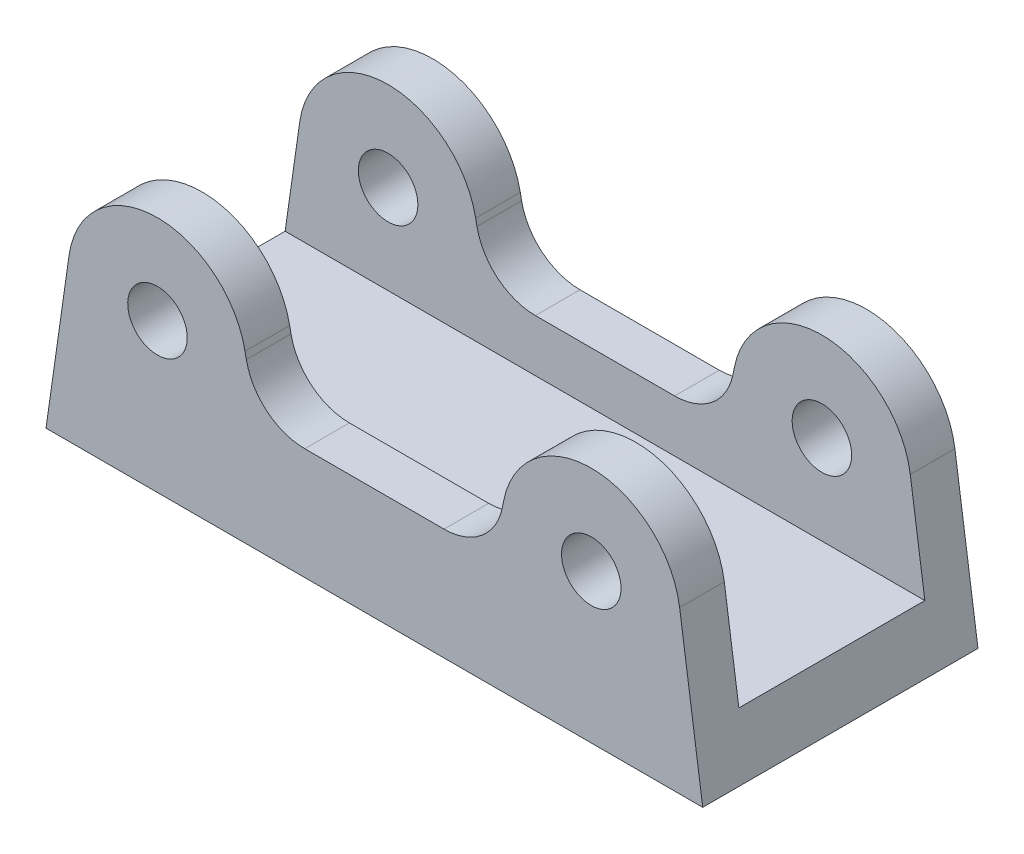
ISO-10303-21;
HEADER;
FILE_DESCRIPTION(('STEP AP214'),'2;1');
FILE_NAME('part.step','',(''),(''),'','','');
FILE_SCHEMA(('AUTOMOTIVE_DESIGN { 1 0 10303 214 1 1 1 1 }'));
ENDSEC;
DATA;
#1=APPLICATION_CONTEXT('core data for automotive mechanical design processes');
#2=APPLICATION_PROTOCOL_DEFINITION('international standard','automotive_design',2000,#1);
#3=PRODUCT_CONTEXT('',#1,'mechanical');
#4=PRODUCT('Part','Part','',(#3));
#5=PRODUCT_RELATED_PRODUCT_CATEGORY('part','',(#4));
#6=PRODUCT_DEFINITION_FORMATION('','',#4);
#7=PRODUCT_DEFINITION_CONTEXT('part definition',#1,'design');
#8=PRODUCT_DEFINITION('design','',#6,#7);
#9=PRODUCT_DEFINITION_SHAPE('','',#8);
#10=(LENGTH_UNIT() NAMED_UNIT(*) SI_UNIT(.MILLI.,.METRE.));
#11=(NAMED_UNIT(*) PLANE_ANGLE_UNIT() SI_UNIT($,.RADIAN.));
#12=(NAMED_UNIT(*) SI_UNIT($,.STERADIAN.) SOLID_ANGLE_UNIT());
#13=UNCERTAINTY_MEASURE_WITH_UNIT(LENGTH_MEASURE(1.E-05),#10,'distance_accuracy_value','');
#14=(GEOMETRIC_REPRESENTATION_CONTEXT(3) GLOBAL_UNCERTAINTY_ASSIGNED_CONTEXT((#13)) GLOBAL_UNIT_ASSIGNED_CONTEXT((#10,
#11,#12)) REPRESENTATION_CONTEXT('',''));
#15=CARTESIAN_POINT('',(0.,0.,0.));
#16=DIRECTION('',(0.,0.,1.));
#17=DIRECTION('',(1.,0.,0.));
#18=AXIS2_PLACEMENT_3D('',#15,#16,#17);
#19=CARTESIAN_POINT('',(-29.155,0.,18.5));
#20=DIRECTION('',(0.,0.,-1.));
#21=DIRECTION('',(-1.,0.,0.));
#22=AXIS2_PLACEMENT_3D('',#19,#20,#21);
#23=CYLINDRICAL_SURFACE('',#22,12.);
#24=DIRECTION('',(0.,0.,-1.));
#25=VECTOR('',#24,1.);
#26=CARTESIAN_POINT('',(-17.3836857304142,2.33155749803532,18.5));
#27=LINE('',#26,#25);
#28=CARTESIAN_POINT('',(-17.3836857304142,2.33155749803532,18.5));
#29=VERTEX_POINT('',#28);
#30=CARTESIAN_POINT('',(-17.3836857304142,2.33155749803532,12.5));
#31=VERTEX_POINT('',#30);
#32=EDGE_CURVE('E191',#29,#31,#27,.T.);
#33=ORIENTED_EDGE('',*,*,#32,.T.);
#34=CARTESIAN_POINT('',(-29.155,0.,12.5));
#35=DIRECTION('',(0.,0.,1.));
#36=DIRECTION('',(0.,-1.,0.));
#37=AXIS2_PLACEMENT_3D('',#34,#35,#36);
#38=CIRCLE('',#37,12.);
#39=CARTESIAN_POINT('',(-41.0341192879015,1.69897761721752,12.5));
#40=VERTEX_POINT('',#39);
#41=EDGE_CURVE('E259',#31,#40,#38,.T.);
#42=ORIENTED_EDGE('',*,*,#41,.T.);
#43=DIRECTION('',(0.,0.,-1.));
#44=VECTOR('',#43,1.);
#45=CARTESIAN_POINT('',(-41.0341192879015,1.69897761721752,18.5));
#46=LINE('',#45,#44);
#47=CARTESIAN_POINT('',(-41.0341192879015,1.69897761721752,18.5));
#48=VERTEX_POINT('',#47);
#49=EDGE_CURVE('E45',#48,#40,#46,.T.);
#50=ORIENTED_EDGE('',*,*,#49,.F.);
#51=CARTESIAN_POINT('',(-29.155,0.,18.5));
#52=DIRECTION('',(0.,0.,1.));
#53=DIRECTION('',(1.,0.,0.));
#54=AXIS2_PLACEMENT_3D('',#51,#52,#53);
#55=CIRCLE('',#54,12.);
#56=EDGE_CURVE('E190',#29,#48,#55,.T.);
#57=ORIENTED_EDGE('',*,*,#56,.F.);
#58=EDGE_LOOP('',(#33,#42,#50,#57));
#59=FACE_BOUND('',#58,.T.);
#60=ADVANCED_FACE('F37',(#59),#23,.T.);
#61=CARTESIAN_POINT('',(29.155,0.,18.5));
#62=DIRECTION('',(0.,0.,-1.));
#63=DIRECTION('',(-1.,0.,0.));
#64=AXIS2_PLACEMENT_3D('',#61,#62,#63);
#65=CYLINDRICAL_SURFACE('',#64,12.);
#66=DIRECTION('',(0.,0.,-1.));
#67=VECTOR('',#66,1.);
#68=CARTESIAN_POINT('',(41.0341192879015,1.69897761721752,18.5));
#69=LINE('',#68,#67);
#70=CARTESIAN_POINT('',(41.0341192879015,1.69897761721752,18.5));
#71=VERTEX_POINT('',#70);
#72=CARTESIAN_POINT('',(41.0341192879015,1.69897761721752,12.5));
#73=VERTEX_POINT('',#72);
#74=EDGE_CURVE('E207',#71,#73,#69,.T.);
#75=ORIENTED_EDGE('',*,*,#74,.T.);
#76=CARTESIAN_POINT('',(29.155,0.,12.5));
#77=DIRECTION('',(0.,0.,1.));
#78=DIRECTION('',(0.,-1.,0.));
#79=AXIS2_PLACEMENT_3D('',#76,#77,#78);
#80=CIRCLE('',#79,12.);
#81=CARTESIAN_POINT('',(17.3836857304142,2.33155749803532,12.5));
#82=VERTEX_POINT('',#81);
#83=EDGE_CURVE('E253',#73,#82,#80,.T.);
#84=ORIENTED_EDGE('',*,*,#83,.T.);
#85=DIRECTION('',(0.,0.,-1.));
#86=VECTOR('',#85,1.);
#87=CARTESIAN_POINT('',(17.3836857304142,2.33155749803532,18.5));
#88=LINE('',#87,#86);
#89=CARTESIAN_POINT('',(17.3836857304142,2.33155749803532,18.5));
#90=VERTEX_POINT('',#89);
#91=EDGE_CURVE('E203',#90,#82,#88,.T.);
#92=ORIENTED_EDGE('',*,*,#91,.F.);
#93=CARTESIAN_POINT('',(29.155,0.,18.5));
#94=DIRECTION('',(0.,0.,1.));
#95=DIRECTION('',(1.,0.,0.));
#96=AXIS2_PLACEMENT_3D('',#93,#94,#95);
#97=CIRCLE('',#96,12.);
#98=EDGE_CURVE('E284',#71,#90,#97,.T.);
#99=ORIENTED_EDGE('',*,*,#98,.F.);
#100=EDGE_LOOP('',(#75,#84,#92,#99));
#101=FACE_BOUND('',#100,.T.);
#102=ADVANCED_FACE('F334',(#101),#65,.T.);
#103=CARTESIAN_POINT('',(17.3836857304142,2.33155749803533,18.5));
#104=DIRECTION('',(0.980942855798827,-0.194296458169575,0.));
#105=DIRECTION('',(0.194296458169575,0.980942855798827,0.));
#106=AXIS2_PLACEMENT_3D('',#103,#104,#105);
#107=PLANE('',#106);
#108=ORIENTED_EDGE('',*,*,#91,.T.);
#109=DIRECTION('',(-0.194296458169575,-0.980942855798827,0.));
#110=VECTOR('',#109,1.);
#111=CARTESIAN_POINT('',(17.3836857304142,2.33155749803533,12.5));
#112=LINE('',#111,#110);
#113=CARTESIAN_POINT('',(17.2082087414962,1.4456283346434,12.5));
#114=VERTEX_POINT('',#113);
#115=EDGE_CURVE('E250',#82,#114,#112,.T.);
#116=ORIENTED_EDGE('',*,*,#115,.T.);
#117=DIRECTION('',(0.,0.,-1.));
#118=VECTOR('',#117,1.);
#119=CARTESIAN_POINT('',(17.2082087414962,1.4456283346434,18.5));
#120=LINE('',#119,#118);
#121=CARTESIAN_POINT('',(17.2082087414962,1.4456283346434,18.5));
#122=VERTEX_POINT('',#121);
#123=EDGE_CURVE('E199',#122,#114,#120,.T.);
#124=ORIENTED_EDGE('',*,*,#123,.F.);
#125=DIRECTION('',(-0.194296458169575,-0.980942855798827,0.));
#126=VECTOR('',#125,1.);
#127=CARTESIAN_POINT('',(17.3836857304142,2.33155749803533,18.5));
#128=LINE('',#127,#126);
#129=EDGE_CURVE('E286',#90,#122,#128,.T.);
#130=ORIENTED_EDGE('',*,*,#129,.F.);
#131=EDGE_LOOP('',(#108,#116,#124,#130));
#132=FACE_BOUND('',#131,.T.);
#133=ADVANCED_FACE('F292',(#132),#107,.F.);
#134=CARTESIAN_POINT('',(9.36066589510556,3.,18.5));
#135=DIRECTION('',(0.,0.,-1.));
#136=DIRECTION('',(-1.,0.,0.));
#137=AXIS2_PLACEMENT_3D('',#134,#135,#136);
#138=CYLINDRICAL_SURFACE('',#137,8.);
#139=ORIENTED_EDGE('',*,*,#123,.T.);
#140=CARTESIAN_POINT('',(9.36066589510556,3.,12.5));
#141=DIRECTION('',(0.,0.,1.));
#142=DIRECTION('',(0.,-1.,0.));
#143=AXIS2_PLACEMENT_3D('',#140,#141,#142);
#144=CIRCLE('',#143,8.);
#145=CARTESIAN_POINT('',(9.36066589510556,-5.,12.5));
#146=VERTEX_POINT('',#145);
#147=EDGE_CURVE('E247',#114,#146,#144,.F.);
#148=ORIENTED_EDGE('',*,*,#147,.T.);
#149=DIRECTION('',(0.,0.,-1.));
#150=VECTOR('',#149,1.);
#151=CARTESIAN_POINT('',(9.36066589510556,-5.,18.5));
#152=LINE('',#151,#150);
#153=CARTESIAN_POINT('',(9.36066589510556,-5.,18.5));
#154=VERTEX_POINT('',#153);
#155=EDGE_CURVE('E196',#154,#146,#152,.T.);
#156=ORIENTED_EDGE('',*,*,#155,.F.);
#157=CARTESIAN_POINT('',(9.36066589510556,3.,18.5));
#158=DIRECTION('',(0.,0.,-1.));
#159=DIRECTION('',(1.,0.,0.));
#160=AXIS2_PLACEMENT_3D('',#157,#158,#159);
#161=CIRCLE('',#160,8.);
#162=EDGE_CURVE('E139',#122,#154,#161,.T.);
#163=ORIENTED_EDGE('',*,*,#162,.F.);
#164=EDGE_LOOP('',(#139,#148,#156,#163));
#165=FACE_BOUND('',#164,.T.);
#166=ADVANCED_FACE('F296',(#165),#138,.F.);
#167=CARTESIAN_POINT('',(-9.36066589510556,-5.,18.5));
#168=DIRECTION('',(0.,-1.,0.));
#169=DIRECTION('',(1.,0.,0.));
#170=AXIS2_PLACEMENT_3D('',#167,#168,#169);
#171=PLANE('',#170);
#172=ORIENTED_EDGE('',*,*,#155,.T.);
#173=DIRECTION('',(-1.,0.,0.));
#174=VECTOR('',#173,1.);
#175=CARTESIAN_POINT('',(-9.36066589510556,-5.,12.5));
#176=LINE('',#175,#174);
#177=CARTESIAN_POINT('',(-9.36066589510556,-5.,12.5));
#178=VERTEX_POINT('',#177);
#179=EDGE_CURVE('E150',#146,#178,#176,.T.);
#180=ORIENTED_EDGE('',*,*,#179,.T.);
#181=DIRECTION('',(0.,0.,-1.));
#182=VECTOR('',#181,1.);
#183=CARTESIAN_POINT('',(-9.36066589510556,-5.,18.5));
#184=LINE('',#183,#182);
#185=CARTESIAN_POINT('',(-9.36066589510556,-5.,18.5));
#186=VERTEX_POINT('',#185);
#187=EDGE_CURVE('E146',#186,#178,#184,.T.);
#188=ORIENTED_EDGE('',*,*,#187,.F.);
#189=DIRECTION('',(-1.,0.,0.));
#190=VECTOR('',#189,1.);
#191=CARTESIAN_POINT('',(-9.36066589510556,-5.,18.5));
#192=LINE('',#191,#190);
#193=EDGE_CURVE('E131',#154,#186,#192,.T.);
#194=ORIENTED_EDGE('',*,*,#193,.F.);
#195=EDGE_LOOP('',(#172,#180,#188,#194));
#196=FACE_BOUND('',#195,.T.);
#197=ADVANCED_FACE('F147',(#196),#171,.F.);
#198=CARTESIAN_POINT('',(-9.36066589510556,3.,18.5));
#199=DIRECTION('',(0.,0.,-1.));
#200=DIRECTION('',(-1.,0.,0.));
#201=AXIS2_PLACEMENT_3D('',#198,#199,#200);
#202=CYLINDRICAL_SURFACE('',#201,8.);
#203=ORIENTED_EDGE('',*,*,#187,.T.);
#204=CARTESIAN_POINT('',(-9.36066589510556,3.,12.5));
#205=DIRECTION('',(0.,0.,1.));
#206=DIRECTION('',(0.,-1.,0.));
#207=AXIS2_PLACEMENT_3D('',#204,#205,#206);
#208=CIRCLE('',#207,8.);
#209=CARTESIAN_POINT('',(-17.2082087414962,1.4456283346434,12.5));
#210=VERTEX_POINT('',#209);
#211=EDGE_CURVE('E244',#178,#210,#208,.F.);
#212=ORIENTED_EDGE('',*,*,#211,.T.);
#213=DIRECTION('',(0.,0.,-1.));
#214=VECTOR('',#213,1.);
#215=CARTESIAN_POINT('',(-17.2082087414962,1.4456283346434,18.5));
#216=LINE('',#215,#214);
#217=CARTESIAN_POINT('',(-17.2082087414962,1.4456283346434,18.5));
#218=VERTEX_POINT('',#217);
#219=EDGE_CURVE('E158',#218,#210,#216,.T.);
#220=ORIENTED_EDGE('',*,*,#219,.F.);
#221=CARTESIAN_POINT('',(-9.36066589510556,3.,18.5));
#222=DIRECTION('',(0.,0.,-1.));
#223=DIRECTION('',(-1.,0.,0.));
#224=AXIS2_PLACEMENT_3D('',#221,#222,#223);
#225=CIRCLE('',#224,8.);
#226=EDGE_CURVE('E136',#186,#218,#225,.T.);
#227=ORIENTED_EDGE('',*,*,#226,.F.);
#228=EDGE_LOOP('',(#203,#212,#220,#227));
#229=FACE_BOUND('',#228,.T.);
#230=ADVANCED_FACE('F156',(#229),#202,.F.);
#231=CARTESIAN_POINT('',(-17.3836857304142,2.33155749803532,18.5));
#232=DIRECTION('',(-0.980942855798827,-0.194296458169575,0.));
#233=DIRECTION('',(0.194296458169575,-0.980942855798827,0.));
#234=AXIS2_PLACEMENT_3D('',#231,#232,#233);
#235=PLANE('',#234);
#236=ORIENTED_EDGE('',*,*,#219,.T.);
#237=DIRECTION('',(-0.194296458169575,0.980942855798827,0.));
#238=VECTOR('',#237,1.);
#239=CARTESIAN_POINT('',(-17.3836857304142,2.33155749803532,12.5));
#240=LINE('',#239,#238);
#241=EDGE_CURVE('E229',#210,#31,#240,.T.);
#242=ORIENTED_EDGE('',*,*,#241,.T.);
#243=ORIENTED_EDGE('',*,*,#32,.F.);
#244=DIRECTION('',(-0.194296458169575,0.980942855798827,0.));
#245=VECTOR('',#244,1.);
#246=CARTESIAN_POINT('',(-17.3836857304142,2.33155749803532,18.5));
#247=LINE('',#246,#245);
#248=EDGE_CURVE('E61',#218,#29,#247,.T.);
#249=ORIENTED_EDGE('',*,*,#248,.F.);
#250=EDGE_LOOP('',(#236,#242,#243,#249));
#251=FACE_BOUND('',#250,.T.);
#252=ADVANCED_FACE('F401',(#251),#235,.F.);
#253=CARTESIAN_POINT('',(29.155,0.,18.5));
#254=DIRECTION('',(0.,0.,-1.));
#255=DIRECTION('',(-1.,0.,0.));
#256=AXIS2_PLACEMENT_3D('',#253,#254,#255);
#257=CYLINDRICAL_SURFACE('',#256,4.00000000000001);
#258=CARTESIAN_POINT('',(29.155,0.,12.5));
#259=DIRECTION('',(0.,0.,1.));
#260=DIRECTION('',(0.,-1.,0.));
#261=AXIS2_PLACEMENT_3D('',#258,#259,#260);
#262=CIRCLE('',#261,4.00000000000001);
#263=CARTESIAN_POINT('',(29.155,-4.00000000000001,12.5));
#264=VERTEX_POINT('',#263);
#265=EDGE_CURVE('E224',#264,#264,#262,.T.);
#266=ORIENTED_EDGE('',*,*,#265,.F.);
#267=EDGE_LOOP('',(#266));
#268=FACE_BOUND('',#267,.T.);
#269=CARTESIAN_POINT('',(29.155,0.,18.5));
#270=DIRECTION('',(0.,0.,1.));
#271=DIRECTION('',(1.,0.,0.));
#272=AXIS2_PLACEMENT_3D('',#269,#270,#271);
#273=CIRCLE('',#272,4.00000000000001);
#274=CARTESIAN_POINT('',(33.155,0.,18.5));
#275=VERTEX_POINT('',#274);
#276=EDGE_CURVE('E166',#275,#275,#273,.T.);
#277=ORIENTED_EDGE('',*,*,#276,.T.);
#278=EDGE_LOOP('',(#277));
#279=FACE_BOUND('',#278,.T.);
#280=ADVANCED_FACE('F451',(#268,#279),#257,.F.);
#281=CARTESIAN_POINT('',(-29.155,0.,18.5));
#282=DIRECTION('',(0.,0.,-1.));
#283=DIRECTION('',(-1.,0.,0.));
#284=AXIS2_PLACEMENT_3D('',#281,#282,#283);
#285=CYLINDRICAL_SURFACE('',#284,4.);
#286=CARTESIAN_POINT('',(-29.155,0.,12.5));
#287=DIRECTION('',(0.,0.,1.));
#288=DIRECTION('',(0.,-1.,0.));
#289=AXIS2_PLACEMENT_3D('',#286,#287,#288);
#290=CIRCLE('',#289,4.);
#291=CARTESIAN_POINT('',(-29.155,-4.,12.5));
#292=VERTEX_POINT('',#291);
#293=EDGE_CURVE('E222',#292,#292,#290,.T.);
#294=ORIENTED_EDGE('',*,*,#293,.F.);
#295=EDGE_LOOP('',(#294));
#296=FACE_BOUND('',#295,.T.);
#297=CARTESIAN_POINT('',(-29.155,0.,18.5));
#298=DIRECTION('',(0.,0.,1.));
#299=DIRECTION('',(1.,0.,0.));
#300=AXIS2_PLACEMENT_3D('',#297,#298,#299);
#301=CIRCLE('',#300,4.);
#302=CARTESIAN_POINT('',(-25.155,0.,18.5));
#303=VERTEX_POINT('',#302);
#304=EDGE_CURVE('E268',#303,#303,#301,.T.);
#305=ORIENTED_EDGE('',*,*,#304,.T.);
#306=EDGE_LOOP('',(#305));
#307=FACE_BOUND('',#306,.T.);
#308=ADVANCED_FACE('F459',(#296,#307),#285,.F.);
#309=CARTESIAN_POINT('',(-29.155,0.,18.5));
#310=DIRECTION('',(0.,0.,1.));
#311=DIRECTION('',(1.,0.,0.));
#312=AXIS2_PLACEMENT_3D('',#309,#310,#311);
#313=PLANE('',#312);
#314=ORIENTED_EDGE('',*,*,#276,.F.);
#315=EDGE_LOOP('',(#314));
#316=FACE_BOUND('',#315,.T.);
#317=ORIENTED_EDGE('',*,*,#56,.T.);
#318=DIRECTION('',(-0.14158146810146,-0.989926607325127,0.));
#319=VECTOR('',#318,1.);
#320=CARTESIAN_POINT('',(-41.0341192879015,1.69897761721752,18.5));
#321=LINE('',#320,#319);
#322=CARTESIAN_POINT('',(-44.1375545169511,-20.,18.5));
#323=VERTEX_POINT('',#322);
#324=EDGE_CURVE('E110',#48,#323,#321,.T.);
#325=ORIENTED_EDGE('',*,*,#324,.T.);
#326=DIRECTION('',(1.,0.,0.));
#327=VECTOR('',#326,1.);
#328=CARTESIAN_POINT('',(-44.1375545169511,-20.,18.5));
#329=LINE('',#328,#327);
#330=CARTESIAN_POINT('',(44.1375545169511,-20.,18.5));
#331=VERTEX_POINT('',#330);
#332=EDGE_CURVE('E280',#323,#331,#329,.T.);
#333=ORIENTED_EDGE('',*,*,#332,.T.);
#334=DIRECTION('',(-0.14158146810146,0.989926607325126,0.));
#335=VECTOR('',#334,1.);
#336=CARTESIAN_POINT('',(41.0341192879015,1.69897761721752,18.5));
#337=LINE('',#336,#335);
#338=EDGE_CURVE('E282',#331,#71,#337,.T.);
#339=ORIENTED_EDGE('',*,*,#338,.T.);
#340=ORIENTED_EDGE('',*,*,#98,.T.);
#341=ORIENTED_EDGE('',*,*,#129,.T.);
#342=ORIENTED_EDGE('',*,*,#162,.T.);
#343=ORIENTED_EDGE('',*,*,#193,.T.);
#344=ORIENTED_EDGE('',*,*,#226,.T.);
#345=ORIENTED_EDGE('',*,*,#248,.T.);
#346=EDGE_LOOP('',(#317,#325,#333,#339,#340,#341,#342,#343,#344,#345));
#347=FACE_BOUND('',#346,.T.);
#348=ORIENTED_EDGE('',*,*,#304,.F.);
#349=EDGE_LOOP('',(#348));
#350=FACE_BOUND('',#349,.T.);
#351=ADVANCED_FACE('F133',(#316,#347,#350),#313,.T.);
#352=CARTESIAN_POINT('',(-29.155,0.,-18.5));
#353=DIRECTION('',(0.,0.,1.));
#354=DIRECTION('',(1.,0.,0.));
#355=AXIS2_PLACEMENT_3D('',#352,#353,#354);
#356=PLANE('',#355);
#357=CARTESIAN_POINT('',(-29.155,0.,-18.5));
#358=DIRECTION('',(0.,0.,1.));
#359=DIRECTION('',(1.,0.,0.));
#360=AXIS2_PLACEMENT_3D('',#357,#358,#359);
#361=CIRCLE('',#360,12.);
#362=CARTESIAN_POINT('',(-17.3836857304142,2.33155749803532,-18.5));
#363=VERTEX_POINT('',#362);
#364=CARTESIAN_POINT('',(-41.0341192879015,1.69897761721752,-18.5));
#365=VERTEX_POINT('',#364);
#366=EDGE_CURVE('E163',#363,#365,#361,.T.);
#367=ORIENTED_EDGE('',*,*,#366,.F.);
#368=DIRECTION('',(-0.194296458169575,0.980942855798827,0.));
#369=VECTOR('',#368,1.);
#370=CARTESIAN_POINT('',(-17.3836857304142,2.33155749803532,-18.5));
#371=LINE('',#370,#369);
#372=CARTESIAN_POINT('',(-17.2082087414962,1.4456283346434,-18.5));
#373=VERTEX_POINT('',#372);
#374=EDGE_CURVE('E188',#373,#363,#371,.T.);
#375=ORIENTED_EDGE('',*,*,#374,.F.);
#376=CARTESIAN_POINT('',(-9.36066589510556,3.,-18.5));
#377=DIRECTION('',(0.,0.,-1.));
#378=DIRECTION('',(-1.,0.,0.));
#379=AXIS2_PLACEMENT_3D('',#376,#377,#378);
#380=CIRCLE('',#379,8.);
#381=CARTESIAN_POINT('',(-9.36066589510556,-5.,-18.5));
#382=VERTEX_POINT('',#381);
#383=EDGE_CURVE('E185',#382,#373,#380,.T.);
#384=ORIENTED_EDGE('',*,*,#383,.F.);
#385=DIRECTION('',(-1.,0.,0.));
#386=VECTOR('',#385,1.);
#387=CARTESIAN_POINT('',(-9.36066589510556,-5.,-18.5));
#388=LINE('',#387,#386);
#389=CARTESIAN_POINT('',(9.36066589510556,-5.,-18.5));
#390=VERTEX_POINT('',#389);
#391=EDGE_CURVE('E182',#390,#382,#388,.T.);
#392=ORIENTED_EDGE('',*,*,#391,.F.);
#393=CARTESIAN_POINT('',(9.36066589510556,3.,-18.5));
#394=DIRECTION('',(0.,0.,-1.));
#395=DIRECTION('',(1.,0.,0.));
#396=AXIS2_PLACEMENT_3D('',#393,#394,#395);
#397=CIRCLE('',#396,8.);
#398=CARTESIAN_POINT('',(17.2082087414962,1.4456283346434,-18.5));
#399=VERTEX_POINT('',#398);
#400=EDGE_CURVE('E179',#399,#390,#397,.T.);
#401=ORIENTED_EDGE('',*,*,#400,.F.);
#402=DIRECTION('',(-0.194296458169575,-0.980942855798827,0.));
#403=VECTOR('',#402,1.);
#404=CARTESIAN_POINT('',(17.3836857304142,2.33155749803533,-18.5));
#405=LINE('',#404,#403);
#406=CARTESIAN_POINT('',(17.3836857304142,2.33155749803532,-18.5));
#407=VERTEX_POINT('',#406);
#408=EDGE_CURVE('E176',#407,#399,#405,.T.);
#409=ORIENTED_EDGE('',*,*,#408,.F.);
#410=CARTESIAN_POINT('',(29.155,0.,-18.5));
#411=DIRECTION('',(0.,0.,1.));
#412=DIRECTION('',(1.,0.,0.));
#413=AXIS2_PLACEMENT_3D('',#410,#411,#412);
#414=CIRCLE('',#413,12.);
#415=CARTESIAN_POINT('',(41.0341192879015,1.69897761721752,-18.5));
#416=VERTEX_POINT('',#415);
#417=EDGE_CURVE('E173',#416,#407,#414,.T.);
#418=ORIENTED_EDGE('',*,*,#417,.F.);
#419=DIRECTION('',(-0.14158146810146,0.989926607325126,0.));
#420=VECTOR('',#419,1.);
#421=CARTESIAN_POINT('',(41.0341192879015,1.69897761721752,-18.5));
#422=LINE('',#421,#420);
#423=CARTESIAN_POINT('',(44.1375545169511,-20.,-18.5));
#424=VERTEX_POINT('',#423);
#425=EDGE_CURVE('E170',#424,#416,#422,.T.);
#426=ORIENTED_EDGE('',*,*,#425,.F.);
#427=DIRECTION('',(1.,0.,0.));
#428=VECTOR('',#427,1.);
#429=CARTESIAN_POINT('',(-44.1375545169511,-20.,-18.5));
#430=LINE('',#429,#428);
#431=CARTESIAN_POINT('',(-44.1375545169511,-20.,-18.5));
#432=VERTEX_POINT('',#431);
#433=EDGE_CURVE('E168',#432,#424,#430,.T.);
#434=ORIENTED_EDGE('',*,*,#433,.F.);
#435=DIRECTION('',(-0.14158146810146,-0.989926607325127,0.));
#436=VECTOR('',#435,1.);
#437=CARTESIAN_POINT('',(-41.0341192879015,1.69897761721752,-18.5));
#438=LINE('',#437,#436);
#439=EDGE_CURVE('E165',#365,#432,#438,.T.);
#440=ORIENTED_EDGE('',*,*,#439,.F.);
#441=EDGE_LOOP('',(#367,#375,#384,#392,#401,#409,#418,#426,#434,#440));
#442=FACE_BOUND('',#441,.T.);
#443=CARTESIAN_POINT('',(29.155,0.,-18.5));
#444=DIRECTION('',(0.,0.,1.));
#445=DIRECTION('',(1.,0.,0.));
#446=AXIS2_PLACEMENT_3D('',#443,#444,#445);
#447=CIRCLE('',#446,4.00000000000001);
#448=CARTESIAN_POINT('',(33.155,0.,-18.5));
#449=VERTEX_POINT('',#448);
#450=EDGE_CURVE('E271',#449,#449,#447,.T.);
#451=ORIENTED_EDGE('',*,*,#450,.T.);
#452=EDGE_LOOP('',(#451));
#453=FACE_BOUND('',#452,.T.);
#454=CARTESIAN_POINT('',(-29.155,0.,-18.5));
#455=DIRECTION('',(0.,0.,1.));
#456=DIRECTION('',(1.,0.,0.));
#457=AXIS2_PLACEMENT_3D('',#454,#455,#456);
#458=CIRCLE('',#457,4.);
#459=CARTESIAN_POINT('',(-25.155,0.,-18.5));
#460=VERTEX_POINT('',#459);
#461=EDGE_CURVE('E267',#460,#460,#458,.T.);
#462=ORIENTED_EDGE('',*,*,#461,.T.);
#463=EDGE_LOOP('',(#462));
#464=FACE_BOUND('',#463,.T.);
#465=ADVANCED_FACE('F332',(#442,#453,#464),#356,.F.);
#466=CARTESIAN_POINT('',(-41.0341192879015,1.69897761721752,-12.5));
#467=VERTEX_POINT('',#466);
#468=EDGE_CURVE('E216',#467,#365,#46,.T.);
#469=ORIENTED_EDGE('',*,*,#468,.F.);
#470=CARTESIAN_POINT('',(-29.155,0.,-12.5));
#471=DIRECTION('',(0.,0.,-1.));
#472=DIRECTION('',(0.,1.,0.));
#473=AXIS2_PLACEMENT_3D('',#470,#471,#472);
#474=CIRCLE('',#473,12.);
#475=CARTESIAN_POINT('',(-17.3836857304142,2.33155749803532,-12.5));
#476=VERTEX_POINT('',#475);
#477=EDGE_CURVE('E232',#467,#476,#474,.T.);
#478=ORIENTED_EDGE('',*,*,#477,.T.);
#479=EDGE_CURVE('E101',#476,#363,#27,.T.);
#480=ORIENTED_EDGE('',*,*,#479,.T.);
#481=ORIENTED_EDGE('',*,*,#366,.T.);
#482=EDGE_LOOP('',(#469,#478,#480,#481));
#483=FACE_BOUND('',#482,.T.);
#484=ADVANCED_FACE('F39',(#483),#23,.T.);
#485=CARTESIAN_POINT('',(-41.0341192879015,1.69897761721752,18.5));
#486=DIRECTION('',(0.989926607325127,-0.14158146810146,0.));
#487=DIRECTION('',(0.14158146810146,0.989926607325127,0.));
#488=AXIS2_PLACEMENT_3D('',#485,#486,#487);
#489=PLANE('',#488);
#490=ORIENTED_EDGE('',*,*,#49,.T.);
#491=DIRECTION('',(-0.14158146810146,-0.989926607325127,0.));
#492=VECTOR('',#491,1.);
#493=CARTESIAN_POINT('',(-41.0341192879015,1.69897761721752,12.5));
#494=LINE('',#493,#492);
#495=CARTESIAN_POINT('',(-42.9933770229527,-12.,12.5));
#496=VERTEX_POINT('',#495);
#497=EDGE_CURVE('E262',#40,#496,#494,.T.);
#498=ORIENTED_EDGE('',*,*,#497,.T.);
#499=DIRECTION('',(0.,0.,-1.));
#500=VECTOR('',#499,1.);
#501=CARTESIAN_POINT('',(-42.9933770229527,-12.,18.5));
#502=LINE('',#501,#500);
#503=CARTESIAN_POINT('',(-42.9933770229527,-12.,-12.5));
#504=VERTEX_POINT('',#503);
#505=EDGE_CURVE('E265',#496,#504,#502,.T.);
#506=ORIENTED_EDGE('',*,*,#505,.T.);
#507=DIRECTION('',(0.14158146810146,0.989926607325127,0.));
#508=VECTOR('',#507,1.);
#509=CARTESIAN_POINT('',(-41.0341192879015,1.69897761721752,-12.5));
#510=LINE('',#509,#508);
#511=EDGE_CURVE('E225',#504,#467,#510,.T.);
#512=ORIENTED_EDGE('',*,*,#511,.T.);
#513=ORIENTED_EDGE('',*,*,#468,.T.);
#514=ORIENTED_EDGE('',*,*,#439,.T.);
#515=DIRECTION('',(0.,0.,-1.));
#516=VECTOR('',#515,1.);
#517=CARTESIAN_POINT('',(-44.1375545169511,-20.,18.5));
#518=LINE('',#517,#516);
#519=EDGE_CURVE('E213',#323,#432,#518,.T.);
#520=ORIENTED_EDGE('',*,*,#519,.F.);
#521=ORIENTED_EDGE('',*,*,#324,.F.);
#522=EDGE_LOOP('',(#490,#498,#506,#512,#513,#514,#520,#521));
#523=FACE_BOUND('',#522,.T.);
#524=ADVANCED_FACE('F322',(#523),#489,.F.);
#525=CARTESIAN_POINT('',(-44.1375545169511,-20.,18.5));
#526=DIRECTION('',(0.,1.,0.));
#527=DIRECTION('',(-1.,0.,0.));
#528=AXIS2_PLACEMENT_3D('',#525,#526,#527);
#529=PLANE('',#528);
#530=ORIENTED_EDGE('',*,*,#433,.T.);
#531=DIRECTION('',(0.,0.,-1.));
#532=VECTOR('',#531,1.);
#533=CARTESIAN_POINT('',(44.1375545169511,-20.,18.5));
#534=LINE('',#533,#532);
#535=EDGE_CURVE('E210',#331,#424,#534,.T.);
#536=ORIENTED_EDGE('',*,*,#535,.F.);
#537=ORIENTED_EDGE('',*,*,#332,.F.);
#538=ORIENTED_EDGE('',*,*,#519,.T.);
#539=EDGE_LOOP('',(#530,#536,#537,#538));
#540=FACE_BOUND('',#539,.T.);
#541=ADVANCED_FACE('F324',(#540),#529,.F.);
#542=CARTESIAN_POINT('',(41.0341192879015,1.69897761721752,18.5));
#543=DIRECTION('',(-0.989926607325127,-0.14158146810146,0.));
#544=DIRECTION('',(0.14158146810146,-0.989926607325126,0.));
#545=AXIS2_PLACEMENT_3D('',#542,#543,#544);
#546=PLANE('',#545);
#547=DIRECTION('',(0.,0.,1.));
#548=VECTOR('',#547,1.);
#549=CARTESIAN_POINT('',(42.9933770229527,-12.,18.5));
#550=LINE('',#549,#548);
#551=CARTESIAN_POINT('',(42.9933770229527,-12.,-12.5));
#552=VERTEX_POINT('',#551);
#553=CARTESIAN_POINT('',(42.9933770229527,-12.,12.5));
#554=VERTEX_POINT('',#553);
#555=EDGE_CURVE('E11',#552,#554,#550,.T.);
#556=ORIENTED_EDGE('',*,*,#555,.T.);
#557=DIRECTION('',(-0.14158146810146,0.989926607325126,0.));
#558=VECTOR('',#557,1.);
#559=CARTESIAN_POINT('',(41.0341192879015,1.69897761721752,12.5));
#560=LINE('',#559,#558);
#561=EDGE_CURVE('E256',#554,#73,#560,.T.);
#562=ORIENTED_EDGE('',*,*,#561,.T.);
#563=ORIENTED_EDGE('',*,*,#74,.F.);
#564=ORIENTED_EDGE('',*,*,#338,.F.);
#565=ORIENTED_EDGE('',*,*,#535,.T.);
#566=ORIENTED_EDGE('',*,*,#425,.T.);
#567=CARTESIAN_POINT('',(41.0341192879015,1.69897761721752,-12.5));
#568=VERTEX_POINT('',#567);
#569=EDGE_CURVE('E206',#568,#416,#69,.T.);
#570=ORIENTED_EDGE('',*,*,#569,.F.);
#571=DIRECTION('',(0.14158146810146,-0.989926607325126,0.));
#572=VECTOR('',#571,1.);
#573=CARTESIAN_POINT('',(41.0341192879015,1.69897761721752,-12.5));
#574=LINE('',#573,#572);
#575=EDGE_CURVE('E238',#568,#552,#574,.T.);
#576=ORIENTED_EDGE('',*,*,#575,.T.);
#577=EDGE_LOOP('',(#556,#562,#563,#564,#565,#566,#570,#576));
#578=FACE_BOUND('',#577,.T.);
#579=ADVANCED_FACE('F329',(#578),#546,.F.);
#580=CARTESIAN_POINT('',(17.3836857304142,2.33155749803532,-12.5));
#581=VERTEX_POINT('',#580);
#582=EDGE_CURVE('E202',#581,#407,#88,.T.);
#583=ORIENTED_EDGE('',*,*,#582,.F.);
#584=CARTESIAN_POINT('',(29.155,0.,-12.5));
#585=DIRECTION('',(0.,0.,-1.));
#586=DIRECTION('',(0.,1.,0.));
#587=AXIS2_PLACEMENT_3D('',#584,#585,#586);
#588=CIRCLE('',#587,12.);
#589=EDGE_CURVE('E361',#581,#568,#588,.T.);
#590=ORIENTED_EDGE('',*,*,#589,.T.);
#591=ORIENTED_EDGE('',*,*,#569,.T.);
#592=ORIENTED_EDGE('',*,*,#417,.T.);
#593=EDGE_LOOP('',(#583,#590,#591,#592));
#594=FACE_BOUND('',#593,.T.);
#595=ADVANCED_FACE('F340',(#594),#65,.T.);
#596=CARTESIAN_POINT('',(17.2082087414962,1.4456283346434,-12.5));
#597=VERTEX_POINT('',#596);
#598=EDGE_CURVE('E198',#597,#399,#120,.T.);
#599=ORIENTED_EDGE('',*,*,#598,.F.);
#600=DIRECTION('',(0.194296458169575,0.980942855798827,0.));
#601=VECTOR('',#600,1.);
#602=CARTESIAN_POINT('',(17.3836857304142,2.33155749803532,-12.5));
#603=LINE('',#602,#601);
#604=EDGE_CURVE('E371',#597,#581,#603,.T.);
#605=ORIENTED_EDGE('',*,*,#604,.T.);
#606=ORIENTED_EDGE('',*,*,#582,.T.);
#607=ORIENTED_EDGE('',*,*,#408,.T.);
#608=EDGE_LOOP('',(#599,#605,#606,#607));
#609=FACE_BOUND('',#608,.T.);
#610=ADVANCED_FACE('F345',(#609),#107,.F.);
#611=CARTESIAN_POINT('',(9.36066589510556,-5.,-12.5));
#612=VERTEX_POINT('',#611);
#613=EDGE_CURVE('E153',#612,#390,#152,.T.);
#614=ORIENTED_EDGE('',*,*,#613,.F.);
#615=CARTESIAN_POINT('',(9.36066589510556,3.,-12.5));
#616=DIRECTION('',(0.,0.,-1.));
#617=DIRECTION('',(0.,1.,0.));
#618=AXIS2_PLACEMENT_3D('',#615,#616,#617);
#619=CIRCLE('',#618,8.);
#620=EDGE_CURVE('E374',#612,#597,#619,.F.);
#621=ORIENTED_EDGE('',*,*,#620,.T.);
#622=ORIENTED_EDGE('',*,*,#598,.T.);
#623=ORIENTED_EDGE('',*,*,#400,.T.);
#624=EDGE_LOOP('',(#614,#621,#622,#623));
#625=FACE_BOUND('',#624,.T.);
#626=ADVANCED_FACE('F353',(#625),#138,.F.);
#627=CARTESIAN_POINT('',(-9.36066589510556,-5.,-12.5));
#628=VERTEX_POINT('',#627);
#629=EDGE_CURVE('E154',#628,#382,#184,.T.);
#630=ORIENTED_EDGE('',*,*,#629,.F.);
#631=DIRECTION('',(1.,0.,0.));
#632=VECTOR('',#631,1.);
#633=CARTESIAN_POINT('',(-9.36066589510556,-5.,-12.5));
#634=LINE('',#633,#632);
#635=EDGE_CURVE('E377',#628,#612,#634,.T.);
#636=ORIENTED_EDGE('',*,*,#635,.T.);
#637=ORIENTED_EDGE('',*,*,#613,.T.);
#638=ORIENTED_EDGE('',*,*,#391,.T.);
#639=EDGE_LOOP('',(#630,#636,#637,#638));
#640=FACE_BOUND('',#639,.T.);
#641=ADVANCED_FACE('F423',(#640),#171,.F.);
#642=CARTESIAN_POINT('',(-17.2082087414962,1.4456283346434,-12.5));
#643=VERTEX_POINT('',#642);
#644=EDGE_CURVE('E194',#643,#373,#216,.T.);
#645=ORIENTED_EDGE('',*,*,#644,.F.);
#646=CARTESIAN_POINT('',(-9.36066589510556,3.,-12.5));
#647=DIRECTION('',(0.,0.,-1.));
#648=DIRECTION('',(0.,1.,0.));
#649=AXIS2_PLACEMENT_3D('',#646,#647,#648);
#650=CIRCLE('',#649,8.);
#651=EDGE_CURVE('E52',#643,#628,#650,.F.);
#652=ORIENTED_EDGE('',*,*,#651,.T.);
#653=ORIENTED_EDGE('',*,*,#629,.T.);
#654=ORIENTED_EDGE('',*,*,#383,.T.);
#655=EDGE_LOOP('',(#645,#652,#653,#654));
#656=FACE_BOUND('',#655,.T.);
#657=ADVANCED_FACE('F435',(#656),#202,.F.);
#658=ORIENTED_EDGE('',*,*,#479,.F.);
#659=DIRECTION('',(0.194296458169575,-0.980942855798827,0.));
#660=VECTOR('',#659,1.);
#661=CARTESIAN_POINT('',(-17.3836857304142,2.33155749803532,-12.5));
#662=LINE('',#661,#660);
#663=EDGE_CURVE('E416',#476,#643,#662,.T.);
#664=ORIENTED_EDGE('',*,*,#663,.T.);
#665=ORIENTED_EDGE('',*,*,#644,.T.);
#666=ORIENTED_EDGE('',*,*,#374,.T.);
#667=EDGE_LOOP('',(#658,#664,#665,#666));
#668=FACE_BOUND('',#667,.T.);
#669=ADVANCED_FACE('F440',(#668),#235,.F.);
#670=CARTESIAN_POINT('',(29.155,0.,-12.5));
#671=DIRECTION('',(0.,0.,-1.));
#672=DIRECTION('',(0.,1.,0.));
#673=AXIS2_PLACEMENT_3D('',#670,#671,#672);
#674=CIRCLE('',#673,4.00000000000001);
#675=CARTESIAN_POINT('',(29.155,4.00000000000001,-12.5));
#676=VERTEX_POINT('',#675);
#677=EDGE_CURVE('E220',#676,#676,#674,.T.);
#678=ORIENTED_EDGE('',*,*,#677,.F.);
#679=EDGE_LOOP('',(#678));
#680=FACE_BOUND('',#679,.T.);
#681=ORIENTED_EDGE('',*,*,#450,.F.);
#682=EDGE_LOOP('',(#681));
#683=FACE_BOUND('',#682,.T.);
#684=ADVANCED_FACE('F442',(#680,#683),#257,.F.);
#685=CARTESIAN_POINT('',(-29.155,0.,-12.5));
#686=DIRECTION('',(0.,0.,-1.));
#687=DIRECTION('',(0.,1.,0.));
#688=AXIS2_PLACEMENT_3D('',#685,#686,#687);
#689=CIRCLE('',#688,4.);
#690=CARTESIAN_POINT('',(-29.155,4.,-12.5));
#691=VERTEX_POINT('',#690);
#692=EDGE_CURVE('E218',#691,#691,#689,.T.);
#693=ORIENTED_EDGE('',*,*,#692,.F.);
#694=EDGE_LOOP('',(#693));
#695=FACE_BOUND('',#694,.T.);
#696=ORIENTED_EDGE('',*,*,#461,.F.);
#697=EDGE_LOOP('',(#696));
#698=FACE_BOUND('',#697,.T.);
#699=ADVANCED_FACE('F448',(#695,#698),#285,.F.);
#700=CARTESIAN_POINT('',(-50.,-12.,12.5));
#701=DIRECTION('',(0.,-1.,0.));
#702=DIRECTION('',(0.,0.,-1.));
#703=AXIS2_PLACEMENT_3D('',#700,#701,#702);
#704=PLANE('',#703);
#705=DIRECTION('',(1.,0.,0.));
#706=VECTOR('',#705,1.);
#707=CARTESIAN_POINT('',(-50.,-12.,12.5));
#708=LINE('',#707,#706);
#709=EDGE_CURVE('E318',#496,#554,#708,.T.);
#710=ORIENTED_EDGE('',*,*,#709,.T.);
#711=ORIENTED_EDGE('',*,*,#555,.F.);
#712=DIRECTION('',(1.,0.,0.));
#713=VECTOR('',#712,1.);
#714=CARTESIAN_POINT('',(-50.,-12.,-12.5));
#715=LINE('',#714,#713);
#716=EDGE_CURVE('E221',#504,#552,#715,.T.);
#717=ORIENTED_EDGE('',*,*,#716,.F.);
#718=ORIENTED_EDGE('',*,*,#505,.F.);
#719=EDGE_LOOP('',(#710,#711,#717,#718));
#720=FACE_BOUND('',#719,.T.);
#721=ADVANCED_FACE('F410',(#720),#704,.F.);
#722=CARTESIAN_POINT('',(-50.,14.4969501030928,12.5));
#723=DIRECTION('',(0.,0.,1.));
#724=DIRECTION('',(0.,-1.,0.));
#725=AXIS2_PLACEMENT_3D('',#722,#723,#724);
#726=PLANE('',#725);
#727=ORIENTED_EDGE('',*,*,#265,.T.);
#728=EDGE_LOOP('',(#727));
#729=FACE_BOUND('',#728,.T.);
#730=ORIENTED_EDGE('',*,*,#293,.T.);
#731=EDGE_LOOP('',(#730));
#732=FACE_BOUND('',#731,.T.);
#733=ORIENTED_EDGE('',*,*,#41,.F.);
#734=ORIENTED_EDGE('',*,*,#241,.F.);
#735=ORIENTED_EDGE('',*,*,#211,.F.);
#736=ORIENTED_EDGE('',*,*,#179,.F.);
#737=ORIENTED_EDGE('',*,*,#147,.F.);
#738=ORIENTED_EDGE('',*,*,#115,.F.);
#739=ORIENTED_EDGE('',*,*,#83,.F.);
#740=ORIENTED_EDGE('',*,*,#561,.F.);
#741=ORIENTED_EDGE('',*,*,#709,.F.);
#742=ORIENTED_EDGE('',*,*,#497,.F.);
#743=EDGE_LOOP('',(#733,#734,#735,#736,#737,#738,#739,#740,#741,#742));
#744=FACE_BOUND('',#743,.T.);
#745=ADVANCED_FACE('F314',(#729,#732,#744),#726,.F.);
#746=CARTESIAN_POINT('',(-50.,14.4969501030928,-12.5));
#747=DIRECTION('',(0.,0.,-1.));
#748=DIRECTION('',(0.,1.,0.));
#749=AXIS2_PLACEMENT_3D('',#746,#747,#748);
#750=PLANE('',#749);
#751=ORIENTED_EDGE('',*,*,#677,.T.);
#752=EDGE_LOOP('',(#751));
#753=FACE_BOUND('',#752,.T.);
#754=ORIENTED_EDGE('',*,*,#692,.T.);
#755=EDGE_LOOP('',(#754));
#756=FACE_BOUND('',#755,.T.);
#757=ORIENTED_EDGE('',*,*,#716,.T.);
#758=ORIENTED_EDGE('',*,*,#575,.F.);
#759=ORIENTED_EDGE('',*,*,#589,.F.);
#760=ORIENTED_EDGE('',*,*,#604,.F.);
#761=ORIENTED_EDGE('',*,*,#620,.F.);
#762=ORIENTED_EDGE('',*,*,#635,.F.);
#763=ORIENTED_EDGE('',*,*,#651,.F.);
#764=ORIENTED_EDGE('',*,*,#663,.F.);
#765=ORIENTED_EDGE('',*,*,#477,.F.);
#766=ORIENTED_EDGE('',*,*,#511,.F.);
#767=EDGE_LOOP('',(#757,#758,#759,#760,#761,#762,#763,#764,#765,#766));
#768=FACE_BOUND('',#767,.T.);
#769=ADVANCED_FACE('F389',(#753,#756,#768),#750,.F.);
#770=CLOSED_SHELL('',(#60,#102,#133,#166,#197,#230,#252,#280,#308,#351,#465,#484,#524,#541,#579,
#595,#610,#626,#641,#657,#669,#684,#699,#721,#745,#769));
#771=MANIFOLD_SOLID_BREP('B2',#770);
#772=ADVANCED_BREP_SHAPE_REPRESENTATION('',(#18,#771),#14);
#773=SHAPE_DEFINITION_REPRESENTATION(#9,#772);
ENDSEC;
END-ISO-10303-21;
